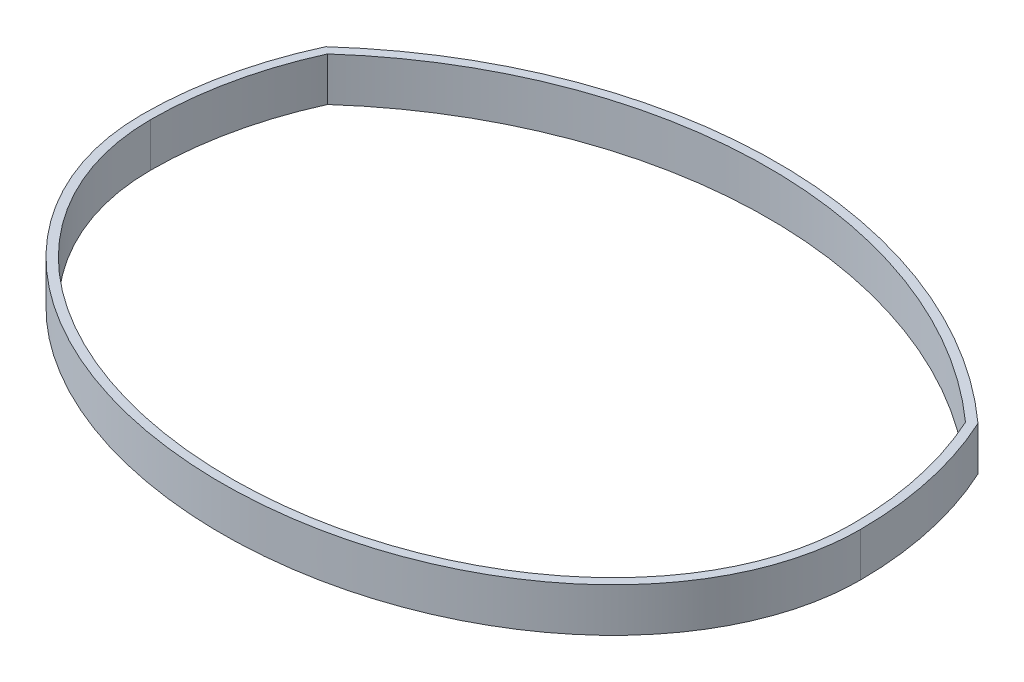
ISO-10303-21;
HEADER;
FILE_DESCRIPTION(('STEP AP214'),'2;1');
FILE_NAME('part.step','',(''),(''),'','','');
FILE_SCHEMA(('AUTOMOTIVE_DESIGN { 1 0 10303 214 1 1 1 1 }'));
ENDSEC;
DATA;
#1=APPLICATION_CONTEXT('core data for automotive mechanical design processes');
#2=APPLICATION_PROTOCOL_DEFINITION('international standard','automotive_design',2000,#1);
#3=PRODUCT_CONTEXT('',#1,'mechanical');
#4=PRODUCT('Part','Part','',(#3));
#5=PRODUCT_RELATED_PRODUCT_CATEGORY('part','',(#4));
#6=PRODUCT_DEFINITION_FORMATION('','',#4);
#7=PRODUCT_DEFINITION_CONTEXT('part definition',#1,'design');
#8=PRODUCT_DEFINITION('design','',#6,#7);
#9=PRODUCT_DEFINITION_SHAPE('','',#8);
#10=(LENGTH_UNIT() NAMED_UNIT(*) SI_UNIT(.MILLI.,.METRE.));
#11=(NAMED_UNIT(*) PLANE_ANGLE_UNIT() SI_UNIT($,.RADIAN.));
#12=(NAMED_UNIT(*) SI_UNIT($,.STERADIAN.) SOLID_ANGLE_UNIT());
#13=UNCERTAINTY_MEASURE_WITH_UNIT(LENGTH_MEASURE(1.E-05),#10,'distance_accuracy_value','');
#14=(GEOMETRIC_REPRESENTATION_CONTEXT(3) GLOBAL_UNCERTAINTY_ASSIGNED_CONTEXT((#13)) GLOBAL_UNIT_ASSIGNED_CONTEXT((#10,
#11,#12)) REPRESENTATION_CONTEXT('',''));
#15=CARTESIAN_POINT('',(0.,0.,0.));
#16=DIRECTION('',(0.,0.,1.));
#17=DIRECTION('',(1.,0.,0.));
#18=AXIS2_PLACEMENT_3D('',#15,#16,#17);
#19=CARTESIAN_POINT('',(0.,12.7,0.));
#20=DIRECTION('',(0.,-1.,0.));
#21=DIRECTION('',(0.,0.,-1.));
#22=AXIS2_PLACEMENT_3D('',#19,#20,#21);
#23=CYLINDRICAL_SURFACE('',#22,104.14);
#24=CARTESIAN_POINT('',(0.,0.,0.));
#25=DIRECTION('',(0.,1.,0.));
#26=DIRECTION('',(0.,0.,1.));
#27=AXIS2_PLACEMENT_3D('',#24,#25,#26);
#28=CIRCLE('',#27,104.14);
#29=CARTESIAN_POINT('',(-94.5401465283261,0.,-43.6726492716279));
#30=VERTEX_POINT('',#29);
#31=CARTESIAN_POINT('',(-104.14,0.,0.));
#32=VERTEX_POINT('',#31);
#33=EDGE_CURVE('E160',#30,#32,#28,.T.);
#34=ORIENTED_EDGE('',*,*,#33,.T.);
#35=DIRECTION('',(0.,-1.,0.));
#36=VECTOR('',#35,1.);
#37=CARTESIAN_POINT('',(-104.14,12.7,0.));
#38=LINE('',#37,#36);
#39=CARTESIAN_POINT('',(-104.14,12.7,0.));
#40=VERTEX_POINT('',#39);
#41=EDGE_CURVE('E11',#40,#32,#38,.T.);
#42=ORIENTED_EDGE('',*,*,#41,.F.);
#43=CARTESIAN_POINT('',(0.,12.7,0.));
#44=DIRECTION('',(0.,1.,0.));
#45=DIRECTION('',(0.,0.,1.));
#46=AXIS2_PLACEMENT_3D('',#43,#44,#45);
#47=CIRCLE('',#46,104.14);
#48=CARTESIAN_POINT('',(-94.5401465283261,12.7,-43.6726492716279));
#49=VERTEX_POINT('',#48);
#50=EDGE_CURVE('E123',#49,#40,#47,.T.);
#51=ORIENTED_EDGE('',*,*,#50,.F.);
#52=DIRECTION('',(0.,-1.,0.));
#53=VECTOR('',#52,1.);
#54=CARTESIAN_POINT('',(-94.5401465283261,12.7,-43.6726492716279));
#55=LINE('',#54,#53);
#56=EDGE_CURVE('E176',#49,#30,#55,.T.);
#57=ORIENTED_EDGE('',*,*,#56,.T.);
#58=EDGE_LOOP('',(#34,#42,#51,#57));
#59=FACE_BOUND('',#58,.T.);
#60=ADVANCED_FACE('F41',(#59),#23,.T.);
#61=CARTESIAN_POINT('',(-104.14,12.7,0.));
#62=CARTESIAN_POINT('',(-104.14,12.7,5.35324594609342));
#63=CARTESIAN_POINT('',(-102.774000244758,12.7,16.0383013062325));
#64=CARTESIAN_POINT('',(-96.7253816651792,12.7,31.4196178431099));
#65=CARTESIAN_POINT('',(-86.9494946782005,12.7,45.5230161215674));
#66=CARTESIAN_POINT('',(-69.4995801895671,12.7,61.9330824931648));
#67=CARTESIAN_POINT('',(-40.6643819964038,12.7,76.7914227357598));
#68=CARTESIAN_POINT('',(0.,12.7,83.026194763437));
#69=CARTESIAN_POINT('',(40.6643819964038,12.7,76.7914227357598));
#70=CARTESIAN_POINT('',(69.4995801895671,12.7,61.9330824931648));
#71=CARTESIAN_POINT('',(86.9494946782006,12.7,45.5230161215674));
#72=CARTESIAN_POINT('',(96.7253816651791,12.7,31.4196178431099));
#73=CARTESIAN_POINT('',(102.774000244758,12.7,16.0383013062325));
#74=CARTESIAN_POINT('',(104.14,12.7,5.35324594609341));
#75=CARTESIAN_POINT('',(104.14,12.7,0.));
#76=B_SPLINE_CURVE_WITH_KNOTS('',3,(#61,#62,#63,#64,#65,#66,#67,#68,#69,#70,#71,#72,#73,#74,
#75),.UNSPECIFIED.,.F.,.F.,(4,1,1,1,1,1,1,1,1,1,1,1,4),(0.,0.196349540849362,0.392699081698724,
0.589048622548086,0.785398163397448,1.17809724509617,1.5707963267949,1.96349540849362,
2.35619449019234,2.55254403104171,2.74889357189107,2.94524311274043,3.14159265358979),.UNSPECIFIED.);
#77=DIRECTION('',(0.,-1.,0.));
#78=VECTOR('',#77,1.);
#79=SURFACE_OF_LINEAR_EXTRUSION('',#76,#78);
#80=CARTESIAN_POINT('',(-104.14,0.,0.));
#81=CARTESIAN_POINT('',(-104.14,0.,5.35324594609342));
#82=CARTESIAN_POINT('',(-102.774000244758,0.,16.0383013062325));
#83=CARTESIAN_POINT('',(-96.7253816651792,0.,31.4196178431099));
#84=CARTESIAN_POINT('',(-86.9494946782005,0.,45.5230161215674));
#85=CARTESIAN_POINT('',(-69.4995801895671,0.,61.9330824931648));
#86=CARTESIAN_POINT('',(-40.6643819964038,0.,76.7914227357598));
#87=CARTESIAN_POINT('',(0.,0.,83.026194763437));
#88=CARTESIAN_POINT('',(40.6643819964038,0.,76.7914227357598));
#89=CARTESIAN_POINT('',(69.4995801895671,0.,61.9330824931648));
#90=CARTESIAN_POINT('',(86.9494946782006,0.,45.5230161215674));
#91=CARTESIAN_POINT('',(96.7253816651791,0.,31.4196178431099));
#92=CARTESIAN_POINT('',(102.774000244758,0.,16.0383013062325));
#93=CARTESIAN_POINT('',(104.14,0.,5.35324594609341));
#94=CARTESIAN_POINT('',(104.14,0.,0.));
#95=B_SPLINE_CURVE_WITH_KNOTS('',3,(#80,#81,#82,#83,#84,#85,#86,#87,#88,#89,#90,#91,#92,#93,
#94),.UNSPECIFIED.,.F.,.F.,(4,1,1,1,1,1,1,1,1,1,1,1,4),(0.,0.196349540849362,0.392699081698724,
0.589048622548086,0.785398163397448,1.17809724509617,1.5707963267949,1.96349540849362,
2.35619449019234,2.55254403104171,2.74889357189107,2.94524311274043,3.14159265358979),.UNSPECIFIED.);
#96=CARTESIAN_POINT('',(104.14,0.,0.));
#97=VERTEX_POINT('',#96);
#98=EDGE_CURVE('E129',#32,#97,#95,.T.);
#99=ORIENTED_EDGE('',*,*,#98,.T.);
#100=DIRECTION('',(0.,-1.,0.));
#101=VECTOR('',#100,1.);
#102=CARTESIAN_POINT('',(104.14,12.7,0.));
#103=LINE('',#102,#101);
#104=CARTESIAN_POINT('',(104.14,12.7,0.));
#105=VERTEX_POINT('',#104);
#106=EDGE_CURVE('E52',#105,#97,#103,.T.);
#107=ORIENTED_EDGE('',*,*,#106,.F.);
#108=EDGE_CURVE('E117',#40,#105,#76,.T.);
#109=ORIENTED_EDGE('',*,*,#108,.F.);
#110=ORIENTED_EDGE('',*,*,#41,.T.);
#111=EDGE_LOOP('',(#99,#107,#109,#110));
#112=FACE_BOUND('',#111,.T.);
#113=ADVANCED_FACE('F128',(#112),#79,.F.);
#114=CARTESIAN_POINT('',(0.,12.7,0.));
#115=DIRECTION('',(0.,-1.,0.));
#116=DIRECTION('',(0.,0.,-1.));
#117=AXIS2_PLACEMENT_3D('',#114,#115,#116);
#118=CYLINDRICAL_SURFACE('',#117,104.14);
#119=CARTESIAN_POINT('',(0.,0.,0.));
#120=DIRECTION('',(0.,1.,0.));
#121=DIRECTION('',(0.,0.,1.));
#122=AXIS2_PLACEMENT_3D('',#119,#120,#121);
#123=CIRCLE('',#122,104.14);
#124=CARTESIAN_POINT('',(94.5401465283261,0.,-43.672649271628));
#125=VERTEX_POINT('',#124);
#126=EDGE_CURVE('E90',#97,#125,#123,.T.);
#127=ORIENTED_EDGE('',*,*,#126,.T.);
#128=DIRECTION('',(0.,-1.,0.));
#129=VECTOR('',#128,1.);
#130=CARTESIAN_POINT('',(94.5401465283261,12.7,-43.672649271628));
#131=LINE('',#130,#129);
#132=CARTESIAN_POINT('',(94.5401465283261,12.7,-43.672649271628));
#133=VERTEX_POINT('',#132);
#134=EDGE_CURVE('E131',#133,#125,#131,.T.);
#135=ORIENTED_EDGE('',*,*,#134,.F.);
#136=CARTESIAN_POINT('',(0.,12.7,0.));
#137=DIRECTION('',(0.,1.,0.));
#138=DIRECTION('',(0.,0.,1.));
#139=AXIS2_PLACEMENT_3D('',#136,#137,#138);
#140=CIRCLE('',#139,104.14);
#141=EDGE_CURVE('E121',#105,#133,#140,.T.);
#142=ORIENTED_EDGE('',*,*,#141,.F.);
#143=ORIENTED_EDGE('',*,*,#106,.T.);
#144=EDGE_LOOP('',(#127,#135,#142,#143));
#145=FACE_BOUND('',#144,.T.);
#146=ADVANCED_FACE('F133',(#145),#118,.T.);
#147=CARTESIAN_POINT('',(0.,12.7,0.));
#148=DIRECTION('',(0.,-1.,0.));
#149=DIRECTION('',(0.,0.,-1.));
#150=AXIS2_PLACEMENT_3D('',#147,#148,#149);
#151=CYLINDRICAL_SURFACE('',#150,101.6);
#152=CARTESIAN_POINT('',(0.,0.,0.));
#153=DIRECTION('',(0.,1.,0.));
#154=DIRECTION('',(0.,0.,1.));
#155=AXIS2_PLACEMENT_3D('',#152,#153,#154);
#156=CIRCLE('',#155,101.6);
#157=CARTESIAN_POINT('',(-92.4508074401865,0.,-42.1355930735234));
#158=VERTEX_POINT('',#157);
#159=CARTESIAN_POINT('',(-101.6,0.,0.));
#160=VERTEX_POINT('',#159);
#161=EDGE_CURVE('E144',#158,#160,#156,.T.);
#162=ORIENTED_EDGE('',*,*,#161,.F.);
#163=DIRECTION('',(0.,-1.,0.));
#164=VECTOR('',#163,1.);
#165=CARTESIAN_POINT('',(-92.4508074401865,12.7,-42.1355930735234));
#166=LINE('',#165,#164);
#167=CARTESIAN_POINT('',(-92.4508074401865,12.7,-42.1355930735234));
#168=VERTEX_POINT('',#167);
#169=EDGE_CURVE('E45',#168,#158,#166,.T.);
#170=ORIENTED_EDGE('',*,*,#169,.F.);
#171=CARTESIAN_POINT('',(0.,12.7,0.));
#172=DIRECTION('',(0.,1.,0.));
#173=DIRECTION('',(0.,0.,1.));
#174=AXIS2_PLACEMENT_3D('',#171,#172,#173);
#175=CIRCLE('',#174,101.6);
#176=CARTESIAN_POINT('',(-101.6,12.7,0.));
#177=VERTEX_POINT('',#176);
#178=EDGE_CURVE('E175',#168,#177,#175,.T.);
#179=ORIENTED_EDGE('',*,*,#178,.T.);
#180=DIRECTION('',(0.,-1.,0.));
#181=VECTOR('',#180,1.);
#182=CARTESIAN_POINT('',(-101.6,12.7,0.));
#183=LINE('',#182,#181);
#184=EDGE_CURVE('E137',#177,#160,#183,.T.);
#185=ORIENTED_EDGE('',*,*,#184,.T.);
#186=EDGE_LOOP('',(#162,#170,#179,#185));
#187=FACE_BOUND('',#186,.T.);
#188=ADVANCED_FACE('F43',(#187),#151,.F.);
#189=CARTESIAN_POINT('',(0.,12.7,61.0492054603025));
#190=DIRECTION('',(0.,-1.,0.));
#191=DIRECTION('',(0.,0.,-1.));
#192=AXIS2_PLACEMENT_3D('',#189,#190,#191);
#193=CYLINDRICAL_SURFACE('',#192,138.543330567764);
#194=CARTESIAN_POINT('',(0.,0.,61.0492054603025));
#195=DIRECTION('',(0.,1.,0.));
#196=DIRECTION('',(0.,0.,1.));
#197=AXIS2_PLACEMENT_3D('',#194,#195,#196);
#198=CIRCLE('',#197,138.543330567764);
#199=CARTESIAN_POINT('',(92.4508074401865,0.,-42.1355930735234));
#200=VERTEX_POINT('',#199);
#201=EDGE_CURVE('E148',#200,#158,#198,.T.);
#202=ORIENTED_EDGE('',*,*,#201,.F.);
#203=DIRECTION('',(0.,-1.,0.));
#204=VECTOR('',#203,1.);
#205=CARTESIAN_POINT('',(92.4508074401865,12.7,-42.1355930735234));
#206=LINE('',#205,#204);
#207=CARTESIAN_POINT('',(92.4508074401865,12.7,-42.1355930735234));
#208=VERTEX_POINT('',#207);
#209=EDGE_CURVE('E185',#208,#200,#206,.T.);
#210=ORIENTED_EDGE('',*,*,#209,.F.);
#211=CARTESIAN_POINT('',(0.,12.7,61.0492054603025));
#212=DIRECTION('',(0.,1.,0.));
#213=DIRECTION('',(0.,0.,1.));
#214=AXIS2_PLACEMENT_3D('',#211,#212,#213);
#215=CIRCLE('',#214,138.543330567764);
#216=EDGE_CURVE('E196',#208,#168,#215,.T.);
#217=ORIENTED_EDGE('',*,*,#216,.T.);
#218=ORIENTED_EDGE('',*,*,#169,.T.);
#219=EDGE_LOOP('',(#202,#210,#217,#218));
#220=FACE_BOUND('',#219,.T.);
#221=ADVANCED_FACE('F194',(#220),#193,.F.);
#222=CARTESIAN_POINT('',(0.,12.7,0.));
#223=DIRECTION('',(0.,-1.,0.));
#224=DIRECTION('',(0.,0.,-1.));
#225=AXIS2_PLACEMENT_3D('',#222,#223,#224);
#226=CYLINDRICAL_SURFACE('',#225,101.6);
#227=CARTESIAN_POINT('',(0.,0.,0.));
#228=DIRECTION('',(0.,1.,0.));
#229=DIRECTION('',(0.,0.,1.));
#230=AXIS2_PLACEMENT_3D('',#227,#228,#229);
#231=CIRCLE('',#230,101.6);
#232=CARTESIAN_POINT('',(101.6,0.,0.));
#233=VERTEX_POINT('',#232);
#234=EDGE_CURVE('E152',#233,#200,#231,.T.);
#235=ORIENTED_EDGE('',*,*,#234,.F.);
#236=DIRECTION('',(0.,-1.,0.));
#237=VECTOR('',#236,1.);
#238=CARTESIAN_POINT('',(101.6,12.7,0.));
#239=LINE('',#238,#237);
#240=CARTESIAN_POINT('',(101.6,12.7,0.));
#241=VERTEX_POINT('',#240);
#242=EDGE_CURVE('E183',#241,#233,#239,.T.);
#243=ORIENTED_EDGE('',*,*,#242,.F.);
#244=CARTESIAN_POINT('',(0.,12.7,0.));
#245=DIRECTION('',(0.,1.,0.));
#246=DIRECTION('',(0.,0.,1.));
#247=AXIS2_PLACEMENT_3D('',#244,#245,#246);
#248=CIRCLE('',#247,101.6);
#249=EDGE_CURVE('E203',#241,#208,#248,.T.);
#250=ORIENTED_EDGE('',*,*,#249,.T.);
#251=ORIENTED_EDGE('',*,*,#209,.T.);
#252=EDGE_LOOP('',(#235,#243,#250,#251));
#253=FACE_BOUND('',#252,.T.);
#254=ADVANCED_FACE('F201',(#253),#226,.F.);
#255=CARTESIAN_POINT('',(0.,12.7,0.));
#256=DIRECTION('',(0.,1.,0.));
#257=DIRECTION('',(-1.,0.,0.));
#258=AXIS2_PLACEMENT_3D('',#255,#256,#257);
#259=ELLIPSE('',#258,101.6,78.407937420878);
#260=DIRECTION('',(0.,-1.,0.));
#261=VECTOR('',#260,1.);
#262=SURFACE_OF_LINEAR_EXTRUSION('',#259,#261);
#263=CARTESIAN_POINT('',(0.,0.,0.));
#264=DIRECTION('',(0.,1.,0.));
#265=DIRECTION('',(-1.,0.,0.));
#266=AXIS2_PLACEMENT_3D('',#263,#264,#265);
#267=ELLIPSE('',#266,101.6,78.407937420878);
#268=EDGE_CURVE('E156',#160,#233,#267,.T.);
#269=ORIENTED_EDGE('',*,*,#268,.F.);
#270=ORIENTED_EDGE('',*,*,#184,.F.);
#271=EDGE_CURVE('E208',#177,#241,#259,.T.);
#272=ORIENTED_EDGE('',*,*,#271,.T.);
#273=ORIENTED_EDGE('',*,*,#242,.T.);
#274=EDGE_LOOP('',(#269,#270,#272,#273));
#275=FACE_BOUND('',#274,.T.);
#276=ADVANCED_FACE('F211',(#275),#262,.T.);
#277=CARTESIAN_POINT('',(0.,12.7,61.0492054603025));
#278=DIRECTION('',(0.,-1.,0.));
#279=DIRECTION('',(0.,0.,-1.));
#280=AXIS2_PLACEMENT_3D('',#277,#278,#279);
#281=CYLINDRICAL_SURFACE('',#280,141.083330567764);
#282=CARTESIAN_POINT('',(0.,0.,61.0492054603025));
#283=DIRECTION('',(0.,1.,0.));
#284=DIRECTION('',(0.,0.,1.));
#285=AXIS2_PLACEMENT_3D('',#282,#283,#284);
#286=CIRCLE('',#285,141.083330567764);
#287=EDGE_CURVE('E96',#125,#30,#286,.T.);
#288=ORIENTED_EDGE('',*,*,#287,.T.);
#289=ORIENTED_EDGE('',*,*,#56,.F.);
#290=CARTESIAN_POINT('',(0.,12.7,61.0492054603025));
#291=DIRECTION('',(0.,1.,0.));
#292=DIRECTION('',(0.,0.,1.));
#293=AXIS2_PLACEMENT_3D('',#290,#291,#292);
#294=CIRCLE('',#293,141.083330567764);
#295=EDGE_CURVE('E61',#133,#49,#294,.T.);
#296=ORIENTED_EDGE('',*,*,#295,.F.);
#297=ORIENTED_EDGE('',*,*,#134,.T.);
#298=EDGE_LOOP('',(#288,#289,#296,#297));
#299=FACE_BOUND('',#298,.T.);
#300=ADVANCED_FACE('F221',(#299),#281,.T.);
#301=CARTESIAN_POINT('',(0.,12.7,0.));
#302=DIRECTION('',(0.,1.,0.));
#303=DIRECTION('',(0.,0.,1.));
#304=AXIS2_PLACEMENT_3D('',#301,#302,#303);
#305=PLANE('',#304);
#306=ORIENTED_EDGE('',*,*,#178,.F.);
#307=ORIENTED_EDGE('',*,*,#216,.F.);
#308=ORIENTED_EDGE('',*,*,#249,.F.);
#309=ORIENTED_EDGE('',*,*,#271,.F.);
#310=EDGE_LOOP('',(#306,#307,#308,#309));
#311=FACE_BOUND('',#310,.T.);
#312=ORIENTED_EDGE('',*,*,#50,.T.);
#313=ORIENTED_EDGE('',*,*,#108,.T.);
#314=ORIENTED_EDGE('',*,*,#141,.T.);
#315=ORIENTED_EDGE('',*,*,#295,.T.);
#316=EDGE_LOOP('',(#312,#313,#314,#315));
#317=FACE_BOUND('',#316,.T.);
#318=ADVANCED_FACE('F119',(#311,#317),#305,.T.);
#319=CARTESIAN_POINT('',(0.,0.,0.));
#320=DIRECTION('',(0.,1.,0.));
#321=DIRECTION('',(0.,0.,1.));
#322=AXIS2_PLACEMENT_3D('',#319,#320,#321);
#323=PLANE('',#322);
#324=ORIENTED_EDGE('',*,*,#161,.T.);
#325=ORIENTED_EDGE('',*,*,#268,.T.);
#326=ORIENTED_EDGE('',*,*,#234,.T.);
#327=ORIENTED_EDGE('',*,*,#201,.T.);
#328=EDGE_LOOP('',(#324,#325,#326,#327));
#329=FACE_BOUND('',#328,.T.);
#330=ORIENTED_EDGE('',*,*,#33,.F.);
#331=ORIENTED_EDGE('',*,*,#287,.F.);
#332=ORIENTED_EDGE('',*,*,#126,.F.);
#333=ORIENTED_EDGE('',*,*,#98,.F.);
#334=EDGE_LOOP('',(#330,#331,#332,#333));
#335=FACE_BOUND('',#334,.T.);
#336=ADVANCED_FACE('F199',(#329,#335),#323,.F.);
#337=CLOSED_SHELL('',(#60,#113,#146,#188,#221,#254,#276,#300,#318,#336));
#338=MANIFOLD_SOLID_BREP('B2',#337);
#339=ADVANCED_BREP_SHAPE_REPRESENTATION('',(#18,#338),#14);
#340=SHAPE_DEFINITION_REPRESENTATION(#9,#339);
ENDSEC;
END-ISO-10303-21;
